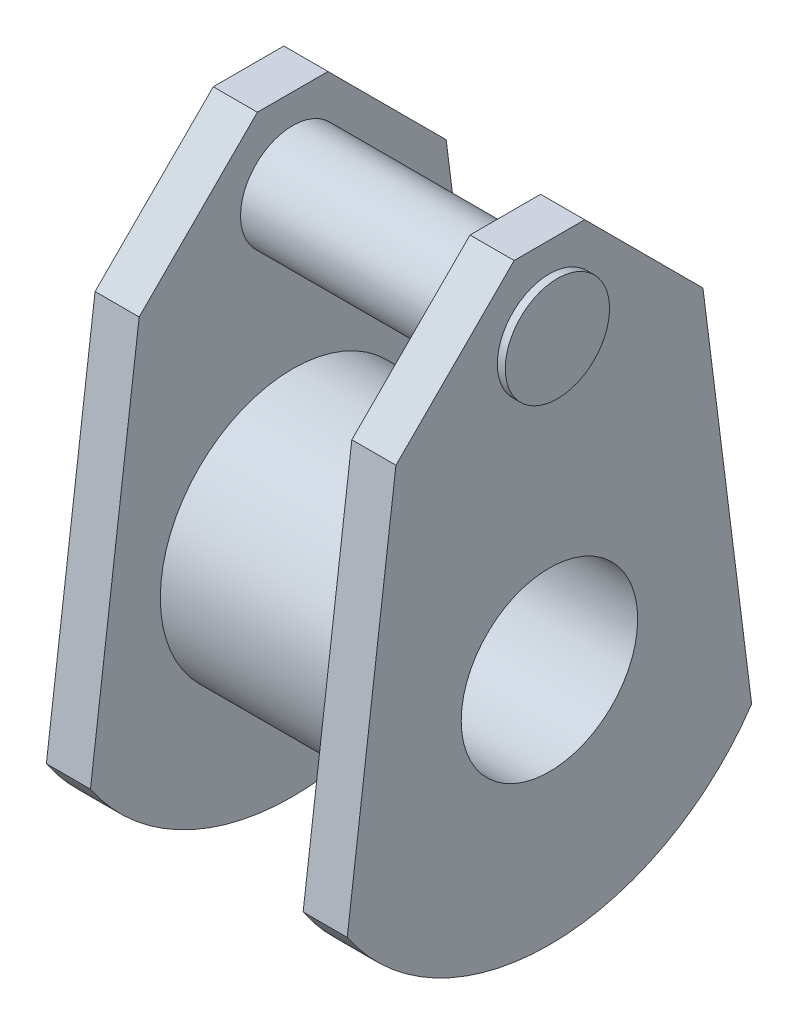
ISO-10303-21;
HEADER;
FILE_DESCRIPTION(('STEP AP214'),'2;1');
FILE_NAME('part.step','',(''),(''),'','','');
FILE_SCHEMA(('AUTOMOTIVE_DESIGN { 1 0 10303 214 1 1 1 1 }'));
ENDSEC;
DATA;
#1=APPLICATION_CONTEXT('core data for automotive mechanical design processes');
#2=APPLICATION_PROTOCOL_DEFINITION('international standard','automotive_design',2000,#1);
#3=PRODUCT_CONTEXT('',#1,'mechanical');
#4=PRODUCT('Part','Part','',(#3));
#5=PRODUCT_RELATED_PRODUCT_CATEGORY('part','',(#4));
#6=PRODUCT_DEFINITION_FORMATION('','',#4);
#7=PRODUCT_DEFINITION_CONTEXT('part definition',#1,'design');
#8=PRODUCT_DEFINITION('design','',#6,#7);
#9=PRODUCT_DEFINITION_SHAPE('','',#8);
#10=(LENGTH_UNIT() NAMED_UNIT(*) SI_UNIT(.MILLI.,.METRE.));
#11=(NAMED_UNIT(*) PLANE_ANGLE_UNIT() SI_UNIT($,.RADIAN.));
#12=(NAMED_UNIT(*) SI_UNIT($,.STERADIAN.) SOLID_ANGLE_UNIT());
#13=UNCERTAINTY_MEASURE_WITH_UNIT(LENGTH_MEASURE(1.E-05),#10,'distance_accuracy_value','');
#14=(GEOMETRIC_REPRESENTATION_CONTEXT(3) GLOBAL_UNCERTAINTY_ASSIGNED_CONTEXT((#13)) GLOBAL_UNIT_ASSIGNED_CONTEXT((#10,
#11,#12)) REPRESENTATION_CONTEXT('',''));
#15=CARTESIAN_POINT('',(0.,0.,0.));
#16=DIRECTION('',(0.,0.,1.));
#17=DIRECTION('',(1.,0.,0.));
#18=AXIS2_PLACEMENT_3D('',#15,#16,#17);
#19=CARTESIAN_POINT('',(12.05,0.,0.));
#20=DIRECTION('',(-1.,0.,0.));
#21=DIRECTION('',(0.,0.,1.));
#22=AXIS2_PLACEMENT_3D('',#19,#20,#21);
#23=CYLINDRICAL_SURFACE('',#22,15.);
#24=CARTESIAN_POINT('',(12.05,0.,0.));
#25=DIRECTION('',(1.,0.,0.));
#26=DIRECTION('',(0.,0.,-1.));
#27=AXIS2_PLACEMENT_3D('',#24,#25,#26);
#28=CIRCLE('',#27,15.);
#29=CARTESIAN_POINT('',(12.05,0.,-15.));
#30=VERTEX_POINT('',#29);
#31=EDGE_CURVE('E155',#30,#30,#28,.T.);
#32=ORIENTED_EDGE('',*,*,#31,.F.);
#33=EDGE_LOOP('',(#32));
#34=FACE_BOUND('',#33,.T.);
#35=CARTESIAN_POINT('',(-12.05,0.,0.));
#36=DIRECTION('',(-1.,0.,0.));
#37=DIRECTION('',(0.,0.,1.));
#38=AXIS2_PLACEMENT_3D('',#35,#36,#37);
#39=CIRCLE('',#38,15.);
#40=CARTESIAN_POINT('',(-12.05,0.,15.));
#41=VERTEX_POINT('',#40);
#42=EDGE_CURVE('E157',#41,#41,#39,.T.);
#43=ORIENTED_EDGE('',*,*,#42,.F.);
#44=EDGE_LOOP('',(#43));
#45=FACE_BOUND('',#44,.T.);
#46=ADVANCED_FACE('F43',(#34,#45),#23,.T.);
#47=CARTESIAN_POINT('',(12.05,0.,0.));
#48=DIRECTION('',(-1.,0.,0.));
#49=DIRECTION('',(0.,0.,1.));
#50=AXIS2_PLACEMENT_3D('',#47,#48,#49);
#51=CYLINDRICAL_SURFACE('',#50,10.);
#52=CARTESIAN_POINT('',(17.05,0.,0.));
#53=DIRECTION('',(1.,0.,0.));
#54=DIRECTION('',(0.,0.,-1.));
#55=AXIS2_PLACEMENT_3D('',#52,#53,#54);
#56=CIRCLE('',#55,10.);
#57=CARTESIAN_POINT('',(17.05,0.,-10.));
#58=VERTEX_POINT('',#57);
#59=EDGE_CURVE('E139',#58,#58,#56,.T.);
#60=ORIENTED_EDGE('',*,*,#59,.T.);
#61=EDGE_LOOP('',(#60));
#62=FACE_BOUND('',#61,.T.);
#63=CARTESIAN_POINT('',(-17.05,0.,0.));
#64=DIRECTION('',(-1.,0.,0.));
#65=DIRECTION('',(0.,0.,1.));
#66=AXIS2_PLACEMENT_3D('',#63,#64,#65);
#67=CIRCLE('',#66,10.);
#68=CARTESIAN_POINT('',(-17.05,0.,10.));
#69=VERTEX_POINT('',#68);
#70=EDGE_CURVE('E226',#69,#69,#67,.T.);
#71=ORIENTED_EDGE('',*,*,#70,.T.);
#72=EDGE_LOOP('',(#71));
#73=FACE_BOUND('',#72,.T.);
#74=ADVANCED_FACE('F257',(#62,#73),#51,.F.);
#75=CARTESIAN_POINT('',(17.05,0.647332808915461,0.));
#76=DIRECTION('',(1.,0.,0.));
#77=DIRECTION('',(0.,0.,-1.));
#78=AXIS2_PLACEMENT_3D('',#75,#76,#77);
#79=PLANE('',#78);
#80=CARTESIAN_POINT('',(17.05,32.9574193594756,0.));
#81=DIRECTION('',(1.,0.,0.));
#82=DIRECTION('',(0.,0.,-1.));
#83=AXIS2_PLACEMENT_3D('',#80,#81,#82);
#84=CIRCLE('',#83,5.90701498138917);
#85=CARTESIAN_POINT('',(17.05,32.9574193594756,-5.90701498138917));
#86=VERTEX_POINT('',#85);
#87=EDGE_CURVE('E12',#86,#86,#84,.T.);
#88=ORIENTED_EDGE('',*,*,#87,.F.);
#89=EDGE_LOOP('',(#88));
#90=FACE_BOUND('',#89,.T.);
#91=DIRECTION('',(0.,0.707106781186554,0.707106781186541));
#92=VECTOR('',#91,1.);
#93=CARTESIAN_POINT('',(17.05,42.1768709505272,-4.));
#94=LINE('',#93,#92);
#95=CARTESIAN_POINT('',(17.05,28.7813158914375,-17.3955550590895));
#96=VERTEX_POINT('',#95);
#97=CARTESIAN_POINT('',(17.05,42.1768709505272,-4.));
#98=VERTEX_POINT('',#97);
#99=EDGE_CURVE('E146',#96,#98,#94,.T.);
#100=ORIENTED_EDGE('',*,*,#99,.T.);
#101=DIRECTION('',(0.,0.,1.));
#102=VECTOR('',#101,1.);
#103=CARTESIAN_POINT('',(17.05,42.1768709505272,4.));
#104=LINE('',#103,#102);
#105=CARTESIAN_POINT('',(17.05,42.1768709505272,4.));
#106=VERTEX_POINT('',#105);
#107=EDGE_CURVE('E100',#98,#106,#104,.T.);
#108=ORIENTED_EDGE('',*,*,#107,.T.);
#109=DIRECTION('',(0.,-0.707106781186554,0.707106781186541));
#110=VECTOR('',#109,1.);
#111=CARTESIAN_POINT('',(17.05,42.1768709505272,4.));
#112=LINE('',#111,#110);
#113=CARTESIAN_POINT('',(17.05,28.7813158914375,17.3955550590895));
#114=VERTEX_POINT('',#113);
#115=EDGE_CURVE('E117',#106,#114,#112,.T.);
#116=ORIENTED_EDGE('',*,*,#115,.T.);
#117=DIRECTION('',(0.,-0.992078684734191,0.125618005461308));
#118=VECTOR('',#117,1.);
#119=CARTESIAN_POINT('',(17.05,28.7813158914375,17.3955550590895));
#120=LINE('',#119,#118);
#121=CARTESIAN_POINT('',(17.05,-14.8052566903872,22.9145309194471));
#122=VERTEX_POINT('',#121);
#123=EDGE_CURVE('E110',#114,#122,#120,.T.);
#124=ORIENTED_EDGE('',*,*,#123,.T.);
#125=CARTESIAN_POINT('',(17.05,0.647332808915461,0.));
#126=DIRECTION('',(1.,0.,0.));
#127=DIRECTION('',(0.,0.,-1.));
#128=AXIS2_PLACEMENT_3D('',#125,#126,#127);
#129=CIRCLE('',#128,27.6379856265296);
#130=CARTESIAN_POINT('',(17.05,-14.8052566903872,-22.9145309194471));
#131=VERTEX_POINT('',#130);
#132=EDGE_CURVE('E115',#122,#131,#129,.T.);
#133=ORIENTED_EDGE('',*,*,#132,.T.);
#134=DIRECTION('',(0.,0.992078684734191,0.125618005461308));
#135=VECTOR('',#134,1.);
#136=CARTESIAN_POINT('',(17.05,28.7813158914375,-17.3955550590895));
#137=LINE('',#136,#135);
#138=EDGE_CURVE('E61',#131,#96,#137,.T.);
#139=ORIENTED_EDGE('',*,*,#138,.T.);
#140=EDGE_LOOP('',(#100,#108,#116,#124,#133,#139));
#141=FACE_BOUND('',#140,.T.);
#142=ORIENTED_EDGE('',*,*,#59,.F.);
#143=EDGE_LOOP('',(#142));
#144=FACE_BOUND('',#143,.T.);
#145=ADVANCED_FACE('F112',(#90,#141,#144),#79,.T.);
#146=CARTESIAN_POINT('',(12.05,0.647332808915461,0.));
#147=DIRECTION('',(1.,0.,0.));
#148=DIRECTION('',(0.,0.,-1.));
#149=AXIS2_PLACEMENT_3D('',#146,#147,#148);
#150=PLANE('',#149);
#151=CARTESIAN_POINT('',(12.05,32.9574193594756,0.));
#152=DIRECTION('',(1.,0.,0.));
#153=DIRECTION('',(0.,0.,-1.));
#154=AXIS2_PLACEMENT_3D('',#151,#152,#153);
#155=CIRCLE('',#154,5.90701498138917);
#156=CARTESIAN_POINT('',(12.05,32.9574193594756,-5.90701498138917));
#157=VERTEX_POINT('',#156);
#158=EDGE_CURVE('E169',#157,#157,#155,.T.);
#159=ORIENTED_EDGE('',*,*,#158,.T.);
#160=EDGE_LOOP('',(#159));
#161=FACE_BOUND('',#160,.T.);
#162=ORIENTED_EDGE('',*,*,#31,.T.);
#163=EDGE_LOOP('',(#162));
#164=FACE_BOUND('',#163,.T.);
#165=DIRECTION('',(0.,0.707106781186554,0.707106781186541));
#166=VECTOR('',#165,1.);
#167=CARTESIAN_POINT('',(12.05,42.1768709505272,-4.));
#168=LINE('',#167,#166);
#169=CARTESIAN_POINT('',(12.05,28.7813158914375,-17.3955550590895));
#170=VERTEX_POINT('',#169);
#171=CARTESIAN_POINT('',(12.05,42.1768709505272,-4.));
#172=VERTEX_POINT('',#171);
#173=EDGE_CURVE('E135',#170,#172,#168,.T.);
#174=ORIENTED_EDGE('',*,*,#173,.F.);
#175=DIRECTION('',(0.,0.992078684734191,0.125618005461308));
#176=VECTOR('',#175,1.);
#177=CARTESIAN_POINT('',(12.05,28.7813158914375,-17.3955550590895));
#178=LINE('',#177,#176);
#179=CARTESIAN_POINT('',(12.05,-14.8052566903872,-22.9145309194471));
#180=VERTEX_POINT('',#179);
#181=EDGE_CURVE('E91',#180,#170,#178,.T.);
#182=ORIENTED_EDGE('',*,*,#181,.F.);
#183=CARTESIAN_POINT('',(12.05,0.647332808915461,0.));
#184=DIRECTION('',(1.,0.,0.));
#185=DIRECTION('',(0.,0.,-1.));
#186=AXIS2_PLACEMENT_3D('',#183,#184,#185);
#187=CIRCLE('',#186,27.6379856265296);
#188=CARTESIAN_POINT('',(12.05,-14.8052566903872,22.9145309194471));
#189=VERTEX_POINT('',#188);
#190=EDGE_CURVE('E85',#189,#180,#187,.T.);
#191=ORIENTED_EDGE('',*,*,#190,.F.);
#192=DIRECTION('',(0.,-0.992078684734191,0.125618005461308));
#193=VECTOR('',#192,1.);
#194=CARTESIAN_POINT('',(12.05,28.7813158914375,17.3955550590895));
#195=LINE('',#194,#193);
#196=CARTESIAN_POINT('',(12.05,28.7813158914375,17.3955550590895));
#197=VERTEX_POINT('',#196);
#198=EDGE_CURVE('E125',#197,#189,#195,.T.);
#199=ORIENTED_EDGE('',*,*,#198,.F.);
#200=DIRECTION('',(0.,-0.707106781186554,0.707106781186541));
#201=VECTOR('',#200,1.);
#202=CARTESIAN_POINT('',(12.05,42.1768709505272,4.));
#203=LINE('',#202,#201);
#204=CARTESIAN_POINT('',(12.05,42.1768709505272,4.));
#205=VERTEX_POINT('',#204);
#206=EDGE_CURVE('E141',#205,#197,#203,.T.);
#207=ORIENTED_EDGE('',*,*,#206,.F.);
#208=DIRECTION('',(0.,0.,1.));
#209=VECTOR('',#208,1.);
#210=CARTESIAN_POINT('',(12.05,42.1768709505272,4.));
#211=LINE('',#210,#209);
#212=EDGE_CURVE('E138',#172,#205,#211,.T.);
#213=ORIENTED_EDGE('',*,*,#212,.F.);
#214=EDGE_LOOP('',(#174,#182,#191,#199,#207,#213));
#215=FACE_BOUND('',#214,.T.);
#216=ADVANCED_FACE('F240',(#161,#164,#215),#150,.F.);
#217=CARTESIAN_POINT('',(17.05,42.1768709505272,-4.));
#218=DIRECTION('',(0.,-0.707106781186541,0.707106781186554));
#219=DIRECTION('',(0.,-0.707106781186554,-0.707106781186541));
#220=AXIS2_PLACEMENT_3D('',#217,#218,#219);
#221=PLANE('',#220);
#222=ORIENTED_EDGE('',*,*,#173,.T.);
#223=DIRECTION('',(-1.,0.,0.));
#224=VECTOR('',#223,1.);
#225=CARTESIAN_POINT('',(17.05,42.1768709505272,-4.));
#226=LINE('',#225,#224);
#227=EDGE_CURVE('E153',#98,#172,#226,.T.);
#228=ORIENTED_EDGE('',*,*,#227,.F.);
#229=ORIENTED_EDGE('',*,*,#99,.F.);
#230=DIRECTION('',(-1.,0.,0.));
#231=VECTOR('',#230,1.);
#232=CARTESIAN_POINT('',(17.05,28.7813158914375,-17.3955550590895));
#233=LINE('',#232,#231);
#234=EDGE_CURVE('E131',#96,#170,#233,.T.);
#235=ORIENTED_EDGE('',*,*,#234,.T.);
#236=EDGE_LOOP('',(#222,#228,#229,#235));
#237=FACE_BOUND('',#236,.T.);
#238=ADVANCED_FACE('F242',(#237),#221,.F.);
#239=CARTESIAN_POINT('',(17.05,42.1768709505272,4.));
#240=DIRECTION('',(0.,-1.,0.));
#241=DIRECTION('',(0.,0.,-1.));
#242=AXIS2_PLACEMENT_3D('',#239,#240,#241);
#243=PLANE('',#242);
#244=ORIENTED_EDGE('',*,*,#212,.T.);
#245=DIRECTION('',(-1.,0.,0.));
#246=VECTOR('',#245,1.);
#247=CARTESIAN_POINT('',(17.05,42.1768709505272,4.));
#248=LINE('',#247,#246);
#249=EDGE_CURVE('E150',#106,#205,#248,.T.);
#250=ORIENTED_EDGE('',*,*,#249,.F.);
#251=ORIENTED_EDGE('',*,*,#107,.F.);
#252=ORIENTED_EDGE('',*,*,#227,.T.);
#253=EDGE_LOOP('',(#244,#250,#251,#252));
#254=FACE_BOUND('',#253,.T.);
#255=ADVANCED_FACE('F234',(#254),#243,.F.);
#256=CARTESIAN_POINT('',(17.05,42.1768709505272,4.));
#257=DIRECTION('',(0.,-0.707106781186541,-0.707106781186554));
#258=DIRECTION('',(0.,0.707106781186554,-0.707106781186541));
#259=AXIS2_PLACEMENT_3D('',#256,#257,#258);
#260=PLANE('',#259);
#261=ORIENTED_EDGE('',*,*,#206,.T.);
#262=DIRECTION('',(-1.,0.,0.));
#263=VECTOR('',#262,1.);
#264=CARTESIAN_POINT('',(17.05,28.7813158914375,17.3955550590895));
#265=LINE('',#264,#263);
#266=EDGE_CURVE('E126',#114,#197,#265,.T.);
#267=ORIENTED_EDGE('',*,*,#266,.F.);
#268=ORIENTED_EDGE('',*,*,#115,.F.);
#269=ORIENTED_EDGE('',*,*,#249,.T.);
#270=EDGE_LOOP('',(#261,#267,#268,#269));
#271=FACE_BOUND('',#270,.T.);
#272=ADVANCED_FACE('F237',(#271),#260,.F.);
#273=CARTESIAN_POINT('',(17.05,28.7813158914375,17.3955550590895));
#274=DIRECTION('',(0.,-0.125618005461308,-0.992078684734191));
#275=DIRECTION('',(0.,0.992078684734191,-0.125618005461308));
#276=AXIS2_PLACEMENT_3D('',#273,#274,#275);
#277=PLANE('',#276);
#278=ORIENTED_EDGE('',*,*,#198,.T.);
#279=DIRECTION('',(-1.,0.,0.));
#280=VECTOR('',#279,1.);
#281=CARTESIAN_POINT('',(17.05,-14.8052566903872,22.9145309194471));
#282=LINE('',#281,#280);
#283=EDGE_CURVE('E122',#122,#189,#282,.T.);
#284=ORIENTED_EDGE('',*,*,#283,.F.);
#285=ORIENTED_EDGE('',*,*,#123,.F.);
#286=ORIENTED_EDGE('',*,*,#266,.T.);
#287=EDGE_LOOP('',(#278,#284,#285,#286));
#288=FACE_BOUND('',#287,.T.);
#289=ADVANCED_FACE('F123',(#288),#277,.F.);
#290=CARTESIAN_POINT('',(17.05,0.647332808915461,0.));
#291=DIRECTION('',(-1.,0.,0.));
#292=DIRECTION('',(0.,0.,1.));
#293=AXIS2_PLACEMENT_3D('',#290,#291,#292);
#294=CYLINDRICAL_SURFACE('',#293,27.6379856265296);
#295=ORIENTED_EDGE('',*,*,#190,.T.);
#296=DIRECTION('',(-1.,0.,0.));
#297=VECTOR('',#296,1.);
#298=CARTESIAN_POINT('',(17.05,-14.8052566903872,-22.9145309194471));
#299=LINE('',#298,#297);
#300=EDGE_CURVE('E127',#131,#180,#299,.T.);
#301=ORIENTED_EDGE('',*,*,#300,.F.);
#302=ORIENTED_EDGE('',*,*,#132,.F.);
#303=ORIENTED_EDGE('',*,*,#283,.T.);
#304=EDGE_LOOP('',(#295,#301,#302,#303));
#305=FACE_BOUND('',#304,.T.);
#306=ADVANCED_FACE('F129',(#305),#294,.T.);
#307=CARTESIAN_POINT('',(17.05,28.7813158914375,-17.3955550590895));
#308=DIRECTION('',(0.,-0.125618005461308,0.992078684734191));
#309=DIRECTION('',(0.,-0.992078684734191,-0.125618005461308));
#310=AXIS2_PLACEMENT_3D('',#307,#308,#309);
#311=PLANE('',#310);
#312=ORIENTED_EDGE('',*,*,#181,.T.);
#313=ORIENTED_EDGE('',*,*,#234,.F.);
#314=ORIENTED_EDGE('',*,*,#138,.F.);
#315=ORIENTED_EDGE('',*,*,#300,.T.);
#316=EDGE_LOOP('',(#312,#313,#314,#315));
#317=FACE_BOUND('',#316,.T.);
#318=ADVANCED_FACE('F243',(#317),#311,.F.);
#319=CARTESIAN_POINT('',(-17.05,0.,0.));
#320=DIRECTION('',(-1.,0.,0.));
#321=DIRECTION('',(0.,0.,1.));
#322=AXIS2_PLACEMENT_3D('',#319,#320,#321);
#323=PLANE('',#322);
#324=CARTESIAN_POINT('',(-17.05,32.9574193594756,0.));
#325=DIRECTION('',(-1.,0.,0.));
#326=DIRECTION('',(0.,0.,1.));
#327=AXIS2_PLACEMENT_3D('',#324,#325,#326);
#328=CIRCLE('',#327,5.90701498138917);
#329=CARTESIAN_POINT('',(-17.05,32.9574193594756,5.90701498138917));
#330=VERTEX_POINT('',#329);
#331=EDGE_CURVE('E52',#330,#330,#328,.T.);
#332=ORIENTED_EDGE('',*,*,#331,.F.);
#333=EDGE_LOOP('',(#332));
#334=FACE_BOUND('',#333,.T.);
#335=ORIENTED_EDGE('',*,*,#70,.F.);
#336=EDGE_LOOP('',(#335));
#337=FACE_BOUND('',#336,.T.);
#338=DIRECTION('',(0.,-0.707106781186554,-0.707106781186541));
#339=VECTOR('',#338,1.);
#340=CARTESIAN_POINT('',(-17.05,28.7813158914375,-17.3955550590895));
#341=LINE('',#340,#339);
#342=CARTESIAN_POINT('',(-17.05,42.1768709505272,-4.));
#343=VERTEX_POINT('',#342);
#344=CARTESIAN_POINT('',(-17.05,28.7813158914375,-17.3955550590895));
#345=VERTEX_POINT('',#344);
#346=EDGE_CURVE('E173',#343,#345,#341,.T.);
#347=ORIENTED_EDGE('',*,*,#346,.T.);
#348=DIRECTION('',(0.,-0.992078684734191,-0.125618005461308));
#349=VECTOR('',#348,1.);
#350=CARTESIAN_POINT('',(-17.05,-14.8052566903872,-22.9145309194471));
#351=LINE('',#350,#349);
#352=CARTESIAN_POINT('',(-17.05,-14.8052566903872,-22.9145309194471));
#353=VERTEX_POINT('',#352);
#354=EDGE_CURVE('E176',#345,#353,#351,.T.);
#355=ORIENTED_EDGE('',*,*,#354,.T.);
#356=CARTESIAN_POINT('',(-17.05,0.647332808915461,0.));
#357=DIRECTION('',(-1.,0.,0.));
#358=DIRECTION('',(0.,0.,1.));
#359=AXIS2_PLACEMENT_3D('',#356,#357,#358);
#360=CIRCLE('',#359,27.6379856265296);
#361=CARTESIAN_POINT('',(-17.05,-14.8052566903872,22.9145309194471));
#362=VERTEX_POINT('',#361);
#363=EDGE_CURVE('E180',#353,#362,#360,.T.);
#364=ORIENTED_EDGE('',*,*,#363,.T.);
#365=DIRECTION('',(0.,0.992078684734191,-0.125618005461308));
#366=VECTOR('',#365,1.);
#367=CARTESIAN_POINT('',(-17.05,28.7813158914375,17.3955550590895));
#368=LINE('',#367,#366);
#369=CARTESIAN_POINT('',(-17.05,28.7813158914375,17.3955550590895));
#370=VERTEX_POINT('',#369);
#371=EDGE_CURVE('E183',#362,#370,#368,.T.);
#372=ORIENTED_EDGE('',*,*,#371,.T.);
#373=DIRECTION('',(0.,0.707106781186554,-0.707106781186541));
#374=VECTOR('',#373,1.);
#375=CARTESIAN_POINT('',(-17.05,42.1768709505272,4.));
#376=LINE('',#375,#374);
#377=CARTESIAN_POINT('',(-17.05,42.1768709505272,4.));
#378=VERTEX_POINT('',#377);
#379=EDGE_CURVE('E186',#370,#378,#376,.T.);
#380=ORIENTED_EDGE('',*,*,#379,.T.);
#381=DIRECTION('',(0.,0.,-1.));
#382=VECTOR('',#381,1.);
#383=CARTESIAN_POINT('',(-17.05,42.1768709505272,-4.));
#384=LINE('',#383,#382);
#385=EDGE_CURVE('E189',#378,#343,#384,.T.);
#386=ORIENTED_EDGE('',*,*,#385,.T.);
#387=EDGE_LOOP('',(#347,#355,#364,#372,#380,#386));
#388=FACE_BOUND('',#387,.T.);
#389=ADVANCED_FACE('F245',(#334,#337,#388),#323,.T.);
#390=CARTESIAN_POINT('',(-12.05,0.647332808915461,0.));
#391=DIRECTION('',(-1.,0.,0.));
#392=DIRECTION('',(0.,0.,1.));
#393=AXIS2_PLACEMENT_3D('',#390,#391,#392);
#394=PLANE('',#393);
#395=CARTESIAN_POINT('',(-12.05,32.9574193594756,0.));
#396=DIRECTION('',(-1.,0.,0.));
#397=DIRECTION('',(0.,0.,1.));
#398=AXIS2_PLACEMENT_3D('',#395,#396,#397);
#399=CIRCLE('',#398,5.90701498138917);
#400=CARTESIAN_POINT('',(-12.05,32.9574193594756,5.90701498138917));
#401=VERTEX_POINT('',#400);
#402=EDGE_CURVE('E46',#401,#401,#399,.T.);
#403=ORIENTED_EDGE('',*,*,#402,.T.);
#404=EDGE_LOOP('',(#403));
#405=FACE_BOUND('',#404,.T.);
#406=DIRECTION('',(0.,-0.707106781186554,-0.707106781186541));
#407=VECTOR('',#406,1.);
#408=CARTESIAN_POINT('',(-12.05,28.7813158914375,-17.3955550590895));
#409=LINE('',#408,#407);
#410=CARTESIAN_POINT('',(-12.05,42.1768709505272,-4.));
#411=VERTEX_POINT('',#410);
#412=CARTESIAN_POINT('',(-12.05,28.7813158914375,-17.3955550590895));
#413=VERTEX_POINT('',#412);
#414=EDGE_CURVE('E171',#411,#413,#409,.T.);
#415=ORIENTED_EDGE('',*,*,#414,.F.);
#416=DIRECTION('',(0.,0.,-1.));
#417=VECTOR('',#416,1.);
#418=CARTESIAN_POINT('',(-12.05,42.1768709505272,-4.));
#419=LINE('',#418,#417);
#420=CARTESIAN_POINT('',(-12.05,42.1768709505272,4.));
#421=VERTEX_POINT('',#420);
#422=EDGE_CURVE('E177',#421,#411,#419,.T.);
#423=ORIENTED_EDGE('',*,*,#422,.F.);
#424=DIRECTION('',(0.,0.707106781186554,-0.707106781186541));
#425=VECTOR('',#424,1.);
#426=CARTESIAN_POINT('',(-12.05,42.1768709505272,4.));
#427=LINE('',#426,#425);
#428=CARTESIAN_POINT('',(-12.05,28.7813158914375,17.3955550590895));
#429=VERTEX_POINT('',#428);
#430=EDGE_CURVE('E204',#429,#421,#427,.T.);
#431=ORIENTED_EDGE('',*,*,#430,.F.);
#432=DIRECTION('',(0.,0.992078684734191,-0.125618005461308));
#433=VECTOR('',#432,1.);
#434=CARTESIAN_POINT('',(-12.05,28.7813158914375,17.3955550590895));
#435=LINE('',#434,#433);
#436=CARTESIAN_POINT('',(-12.05,-14.8052566903872,22.9145309194471));
#437=VERTEX_POINT('',#436);
#438=EDGE_CURVE('E201',#437,#429,#435,.T.);
#439=ORIENTED_EDGE('',*,*,#438,.F.);
#440=CARTESIAN_POINT('',(-12.05,0.647332808915461,0.));
#441=DIRECTION('',(-1.,0.,0.));
#442=DIRECTION('',(0.,0.,1.));
#443=AXIS2_PLACEMENT_3D('',#440,#441,#442);
#444=CIRCLE('',#443,27.6379856265296);
#445=CARTESIAN_POINT('',(-12.05,-14.8052566903872,-22.9145309194471));
#446=VERTEX_POINT('',#445);
#447=EDGE_CURVE('E198',#446,#437,#444,.T.);
#448=ORIENTED_EDGE('',*,*,#447,.F.);
#449=DIRECTION('',(0.,-0.992078684734191,-0.125618005461308));
#450=VECTOR('',#449,1.);
#451=CARTESIAN_POINT('',(-12.05,-14.8052566903872,-22.9145309194471));
#452=LINE('',#451,#450);
#453=EDGE_CURVE('E195',#413,#446,#452,.T.);
#454=ORIENTED_EDGE('',*,*,#453,.F.);
#455=EDGE_LOOP('',(#415,#423,#431,#439,#448,#454));
#456=FACE_BOUND('',#455,.T.);
#457=ORIENTED_EDGE('',*,*,#42,.T.);
#458=EDGE_LOOP('',(#457));
#459=FACE_BOUND('',#458,.T.);
#460=ADVANCED_FACE('F251',(#405,#456,#459),#394,.F.);
#461=CARTESIAN_POINT('',(-17.05,28.7813158914375,-17.3955550590895));
#462=DIRECTION('',(0.,-0.707106781186541,0.707106781186554));
#463=DIRECTION('',(0.,-0.707106781186554,-0.707106781186541));
#464=AXIS2_PLACEMENT_3D('',#461,#462,#463);
#465=PLANE('',#464);
#466=ORIENTED_EDGE('',*,*,#414,.T.);
#467=DIRECTION('',(1.,0.,0.));
#468=VECTOR('',#467,1.);
#469=CARTESIAN_POINT('',(-17.05,28.7813158914375,-17.3955550590895));
#470=LINE('',#469,#468);
#471=EDGE_CURVE('E223',#345,#413,#470,.T.);
#472=ORIENTED_EDGE('',*,*,#471,.F.);
#473=ORIENTED_EDGE('',*,*,#346,.F.);
#474=DIRECTION('',(1.,0.,0.));
#475=VECTOR('',#474,1.);
#476=CARTESIAN_POINT('',(-17.05,42.1768709505272,-4.));
#477=LINE('',#476,#475);
#478=EDGE_CURVE('E192',#343,#411,#477,.T.);
#479=ORIENTED_EDGE('',*,*,#478,.T.);
#480=EDGE_LOOP('',(#466,#472,#473,#479));
#481=FACE_BOUND('',#480,.T.);
#482=ADVANCED_FACE('F276',(#481),#465,.F.);
#483=CARTESIAN_POINT('',(-17.05,-14.8052566903872,-22.9145309194471));
#484=DIRECTION('',(0.,-0.125618005461308,0.992078684734191));
#485=DIRECTION('',(0.,-0.992078684734191,-0.125618005461308));
#486=AXIS2_PLACEMENT_3D('',#483,#484,#485);
#487=PLANE('',#486);
#488=ORIENTED_EDGE('',*,*,#453,.T.);
#489=DIRECTION('',(1.,0.,0.));
#490=VECTOR('',#489,1.);
#491=CARTESIAN_POINT('',(-17.05,-14.8052566903872,-22.9145309194471));
#492=LINE('',#491,#490);
#493=EDGE_CURVE('E220',#353,#446,#492,.T.);
#494=ORIENTED_EDGE('',*,*,#493,.F.);
#495=ORIENTED_EDGE('',*,*,#354,.F.);
#496=ORIENTED_EDGE('',*,*,#471,.T.);
#497=EDGE_LOOP('',(#488,#494,#495,#496));
#498=FACE_BOUND('',#497,.T.);
#499=ADVANCED_FACE('F279',(#498),#487,.F.);
#500=CARTESIAN_POINT('',(-17.05,0.647332808915461,0.));
#501=DIRECTION('',(1.,0.,0.));
#502=DIRECTION('',(0.,0.,-1.));
#503=AXIS2_PLACEMENT_3D('',#500,#501,#502);
#504=CYLINDRICAL_SURFACE('',#503,27.6379856265296);
#505=ORIENTED_EDGE('',*,*,#447,.T.);
#506=DIRECTION('',(1.,0.,0.));
#507=VECTOR('',#506,1.);
#508=CARTESIAN_POINT('',(-17.05,-14.8052566903872,22.9145309194471));
#509=LINE('',#508,#507);
#510=EDGE_CURVE('E217',#362,#437,#509,.T.);
#511=ORIENTED_EDGE('',*,*,#510,.F.);
#512=ORIENTED_EDGE('',*,*,#363,.F.);
#513=ORIENTED_EDGE('',*,*,#493,.T.);
#514=EDGE_LOOP('',(#505,#511,#512,#513));
#515=FACE_BOUND('',#514,.T.);
#516=ADVANCED_FACE('F283',(#515),#504,.T.);
#517=CARTESIAN_POINT('',(-17.05,28.7813158914375,17.3955550590895));
#518=DIRECTION('',(0.,-0.125618005461308,-0.992078684734191));
#519=DIRECTION('',(0.,0.992078684734191,-0.125618005461308));
#520=AXIS2_PLACEMENT_3D('',#517,#518,#519);
#521=PLANE('',#520);
#522=ORIENTED_EDGE('',*,*,#438,.T.);
#523=DIRECTION('',(1.,0.,0.));
#524=VECTOR('',#523,1.);
#525=CARTESIAN_POINT('',(-17.05,28.7813158914375,17.3955550590895));
#526=LINE('',#525,#524);
#527=EDGE_CURVE('E214',#370,#429,#526,.T.);
#528=ORIENTED_EDGE('',*,*,#527,.F.);
#529=ORIENTED_EDGE('',*,*,#371,.F.);
#530=ORIENTED_EDGE('',*,*,#510,.T.);
#531=EDGE_LOOP('',(#522,#528,#529,#530));
#532=FACE_BOUND('',#531,.T.);
#533=ADVANCED_FACE('F287',(#532),#521,.F.);
#534=CARTESIAN_POINT('',(-17.05,42.1768709505272,4.));
#535=DIRECTION('',(0.,-0.707106781186541,-0.707106781186554));
#536=DIRECTION('',(0.,0.707106781186554,-0.707106781186541));
#537=AXIS2_PLACEMENT_3D('',#534,#535,#536);
#538=PLANE('',#537);
#539=ORIENTED_EDGE('',*,*,#430,.T.);
#540=DIRECTION('',(1.,0.,0.));
#541=VECTOR('',#540,1.);
#542=CARTESIAN_POINT('',(-17.05,42.1768709505272,4.));
#543=LINE('',#542,#541);
#544=EDGE_CURVE('E211',#378,#421,#543,.T.);
#545=ORIENTED_EDGE('',*,*,#544,.F.);
#546=ORIENTED_EDGE('',*,*,#379,.F.);
#547=ORIENTED_EDGE('',*,*,#527,.T.);
#548=EDGE_LOOP('',(#539,#545,#546,#547));
#549=FACE_BOUND('',#548,.T.);
#550=ADVANCED_FACE('F291',(#549),#538,.F.);
#551=CARTESIAN_POINT('',(-17.05,42.1768709505272,-4.));
#552=DIRECTION('',(0.,-1.,0.));
#553=DIRECTION('',(0.,0.,-1.));
#554=AXIS2_PLACEMENT_3D('',#551,#552,#553);
#555=PLANE('',#554);
#556=ORIENTED_EDGE('',*,*,#422,.T.);
#557=ORIENTED_EDGE('',*,*,#478,.F.);
#558=ORIENTED_EDGE('',*,*,#385,.F.);
#559=ORIENTED_EDGE('',*,*,#544,.T.);
#560=EDGE_LOOP('',(#556,#557,#558,#559));
#561=FACE_BOUND('',#560,.T.);
#562=ADVANCED_FACE('F295',(#561),#555,.F.);
#563=CARTESIAN_POINT('',(17.95,32.9574193594756,0.));
#564=DIRECTION('',(-1.,0.,0.));
#565=DIRECTION('',(0.,0.,1.));
#566=AXIS2_PLACEMENT_3D('',#563,#564,#565);
#567=CYLINDRICAL_SURFACE('',#566,5.90701498138917);
#568=ORIENTED_EDGE('',*,*,#402,.F.);
#569=EDGE_LOOP('',(#568));
#570=FACE_BOUND('',#569,.T.);
#571=ORIENTED_EDGE('',*,*,#158,.F.);
#572=EDGE_LOOP('',(#571));
#573=FACE_BOUND('',#572,.T.);
#574=ADVANCED_FACE('F299',(#570,#573),#567,.T.);
#575=CARTESIAN_POINT('',(-18.05,32.9574193594756,0.));
#576=DIRECTION('',(-1.,0.,0.));
#577=DIRECTION('',(0.,0.,1.));
#578=AXIS2_PLACEMENT_3D('',#575,#576,#577);
#579=PLANE('',#578);
#580=CARTESIAN_POINT('',(-18.05,32.9574193594756,0.));
#581=DIRECTION('',(-1.,0.,0.));
#582=DIRECTION('',(0.,0.,1.));
#583=AXIS2_PLACEMENT_3D('',#580,#581,#582);
#584=CIRCLE('',#583,5.90701498138917);
#585=CARTESIAN_POINT('',(-18.05,32.9574193594756,5.90701498138917));
#586=VERTEX_POINT('',#585);
#587=EDGE_CURVE('E321',#586,#586,#584,.T.);
#588=ORIENTED_EDGE('',*,*,#587,.T.);
#589=EDGE_LOOP('',(#588));
#590=FACE_BOUND('',#589,.T.);
#591=ADVANCED_FACE('F308',(#590),#579,.T.);
#592=ORIENTED_EDGE('',*,*,#331,.T.);
#593=EDGE_LOOP('',(#592));
#594=FACE_BOUND('',#593,.T.);
#595=ORIENTED_EDGE('',*,*,#587,.F.);
#596=EDGE_LOOP('',(#595));
#597=FACE_BOUND('',#596,.T.);
#598=ADVANCED_FACE('F304',(#594,#597),#567,.T.);
#599=ORIENTED_EDGE('',*,*,#87,.T.);
#600=EDGE_LOOP('',(#599));
#601=FACE_BOUND('',#600,.T.);
#602=CARTESIAN_POINT('',(17.95,32.9574193594756,0.));
#603=DIRECTION('',(-1.,0.,0.));
#604=DIRECTION('',(0.,0.,1.));
#605=AXIS2_PLACEMENT_3D('',#602,#603,#604);
#606=CIRCLE('',#605,5.90701498138917);
#607=CARTESIAN_POINT('',(17.95,32.9574193594756,5.90701498138917));
#608=VERTEX_POINT('',#607);
#609=EDGE_CURVE('E167',#608,#608,#606,.T.);
#610=ORIENTED_EDGE('',*,*,#609,.T.);
#611=EDGE_LOOP('',(#610));
#612=FACE_BOUND('',#611,.T.);
#613=ADVANCED_FACE('F307',(#601,#612),#567,.T.);
#614=CARTESIAN_POINT('',(17.95,32.9574193594756,0.));
#615=DIRECTION('',(-1.,0.,0.));
#616=DIRECTION('',(0.,0.,1.));
#617=AXIS2_PLACEMENT_3D('',#614,#615,#616);
#618=PLANE('',#617);
#619=ORIENTED_EDGE('',*,*,#609,.F.);
#620=EDGE_LOOP('',(#619));
#621=FACE_BOUND('',#620,.T.);
#622=ADVANCED_FACE('F309',(#621),#618,.F.);
#623=CLOSED_SHELL('',(#46,#74,#145,#216,#238,#255,#272,#289,#306,#318,#389,#460,#482,#499,#516,
#533,#550,#562,#574,#591,#598,#613,#622));
#624=MANIFOLD_SOLID_BREP('B2',#623);
#625=ADVANCED_BREP_SHAPE_REPRESENTATION('',(#18,#624),#14);
#626=SHAPE_DEFINITION_REPRESENTATION(#9,#625);
ENDSEC;
END-ISO-10303-21;
